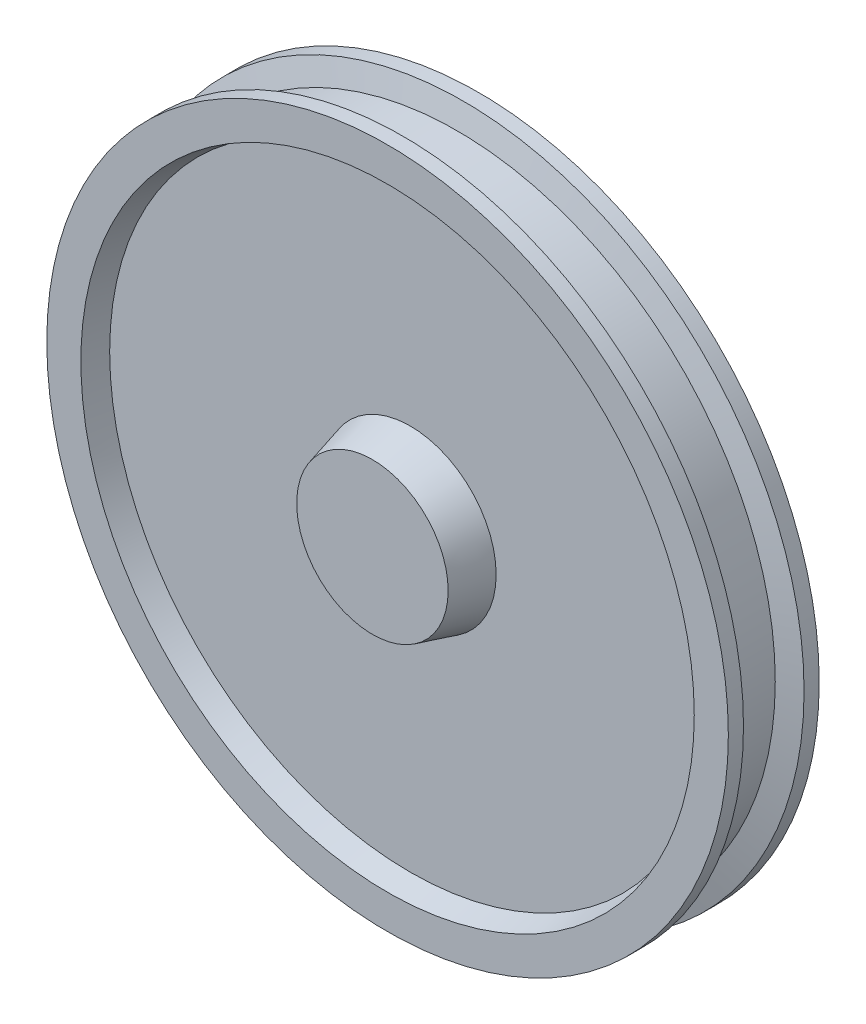
ISO-10303-21;
HEADER;
FILE_DESCRIPTION(('STEP AP214'),'2;1');
FILE_NAME('part.step','',(''),(''),'','','');
FILE_SCHEMA(('AUTOMOTIVE_DESIGN { 1 0 10303 214 1 1 1 1 }'));
ENDSEC;
DATA;
#1=APPLICATION_CONTEXT('core data for automotive mechanical design processes');
#2=APPLICATION_PROTOCOL_DEFINITION('international standard','automotive_design',2000,#1);
#3=PRODUCT_CONTEXT('',#1,'mechanical');
#4=PRODUCT('Part','Part','',(#3));
#5=PRODUCT_RELATED_PRODUCT_CATEGORY('part','',(#4));
#6=PRODUCT_DEFINITION_FORMATION('','',#4);
#7=PRODUCT_DEFINITION_CONTEXT('part definition',#1,'design');
#8=PRODUCT_DEFINITION('design','',#6,#7);
#9=PRODUCT_DEFINITION_SHAPE('','',#8);
#10=(LENGTH_UNIT() NAMED_UNIT(*) SI_UNIT(.MILLI.,.METRE.));
#11=(NAMED_UNIT(*) PLANE_ANGLE_UNIT() SI_UNIT($,.RADIAN.));
#12=(NAMED_UNIT(*) SI_UNIT($,.STERADIAN.) SOLID_ANGLE_UNIT());
#13=UNCERTAINTY_MEASURE_WITH_UNIT(LENGTH_MEASURE(1.E-05),#10,'distance_accuracy_value','');
#14=(GEOMETRIC_REPRESENTATION_CONTEXT(3) GLOBAL_UNCERTAINTY_ASSIGNED_CONTEXT((#13)) GLOBAL_UNIT_ASSIGNED_CONTEXT((#10,
#11,#12)) REPRESENTATION_CONTEXT('',''));
#15=CARTESIAN_POINT('',(0.,0.,0.));
#16=DIRECTION('',(0.,0.,1.));
#17=DIRECTION('',(1.,0.,0.));
#18=AXIS2_PLACEMENT_3D('',#15,#16,#17);
#19=CARTESIAN_POINT('',(0.,0.,60.));
#20=DIRECTION('',(0.,0.,1.));
#21=DIRECTION('',(1.,0.,0.));
#22=AXIS2_PLACEMENT_3D('',#19,#20,#21);
#23=CONICAL_SURFACE('',#22,405.,0.261799387799142);
#24=CARTESIAN_POINT('',(0.,0.,30.));
#25=DIRECTION('',(0.,0.,1.));
#26=DIRECTION('',(1.,0.,0.));
#27=AXIS2_PLACEMENT_3D('',#24,#25,#26);
#28=CIRCLE('',#27,396.961524227067);
#29=CARTESIAN_POINT('',(396.961524227067,0.,30.));
#30=VERTEX_POINT('',#29);
#31=EDGE_CURVE('E10',#30,#30,#28,.T.);
#32=ORIENTED_EDGE('',*,*,#31,.F.);
#33=EDGE_LOOP('',(#32));
#34=FACE_BOUND('',#33,.T.);
#35=CARTESIAN_POINT('',(0.,0.,60.));
#36=DIRECTION('',(0.,0.,1.));
#37=DIRECTION('',(1.,0.,0.));
#38=AXIS2_PLACEMENT_3D('',#35,#36,#37);
#39=CIRCLE('',#38,405.);
#40=CARTESIAN_POINT('',(405.,0.,60.));
#41=VERTEX_POINT('',#40);
#42=EDGE_CURVE('E96',#41,#41,#39,.T.);
#43=ORIENTED_EDGE('',*,*,#42,.T.);
#44=EDGE_LOOP('',(#43));
#45=FACE_BOUND('',#44,.T.);
#46=ADVANCED_FACE('F37',(#34,#45),#23,.F.);
#47=CARTESIAN_POINT('',(0.,113.397459621556,30.));
#48=DIRECTION('',(0.,0.,-1.));
#49=DIRECTION('',(-1.,0.,0.));
#50=AXIS2_PLACEMENT_3D('',#47,#48,#49);
#51=PLANE('',#50);
#52=CARTESIAN_POINT('',(0.,0.,30.));
#53=DIRECTION('',(0.,0.,1.));
#54=DIRECTION('',(1.,0.,0.));
#55=AXIS2_PLACEMENT_3D('',#52,#53,#54);
#56=CIRCLE('',#55,113.397459621556);
#57=CARTESIAN_POINT('',(113.397459621556,0.,30.));
#58=VERTEX_POINT('',#57);
#59=EDGE_CURVE('E44',#58,#58,#56,.T.);
#60=ORIENTED_EDGE('',*,*,#59,.F.);
#61=EDGE_LOOP('',(#60));
#62=FACE_BOUND('',#61,.T.);
#63=ORIENTED_EDGE('',*,*,#31,.T.);
#64=EDGE_LOOP('',(#63));
#65=FACE_BOUND('',#64,.T.);
#66=ADVANCED_FACE('F173',(#62,#65),#51,.F.);
#67=CARTESIAN_POINT('',(0.,0.,30.));
#68=DIRECTION('',(0.,0.,-1.));
#69=DIRECTION('',(-1.,0.,0.));
#70=AXIS2_PLACEMENT_3D('',#67,#68,#69);
#71=CONICAL_SURFACE('',#70,113.397459621556,0.26179938779915);
#72=CARTESIAN_POINT('',(0.,0.,80.));
#73=DIRECTION('',(0.,0.,1.));
#74=DIRECTION('',(1.,0.,0.));
#75=AXIS2_PLACEMENT_3D('',#72,#73,#74);
#76=CIRCLE('',#75,100.);
#77=CARTESIAN_POINT('',(100.,0.,80.));
#78=VERTEX_POINT('',#77);
#79=EDGE_CURVE('E49',#78,#78,#76,.T.);
#80=ORIENTED_EDGE('',*,*,#79,.F.);
#81=EDGE_LOOP('',(#80));
#82=FACE_BOUND('',#81,.T.);
#83=ORIENTED_EDGE('',*,*,#59,.T.);
#84=EDGE_LOOP('',(#83));
#85=FACE_BOUND('',#84,.T.);
#86=ADVANCED_FACE('F169',(#82,#85),#71,.T.);
#87=CARTESIAN_POINT('',(0.,0.,80.));
#88=DIRECTION('',(0.,0.,-1.));
#89=DIRECTION('',(-1.,0.,0.));
#90=AXIS2_PLACEMENT_3D('',#87,#88,#89);
#91=PLANE('',#90);
#92=ORIENTED_EDGE('',*,*,#79,.T.);
#93=EDGE_LOOP('',(#92));
#94=FACE_BOUND('',#93,.T.);
#95=ADVANCED_FACE('F164',(#94),#91,.F.);
#96=CARTESIAN_POINT('',(0.,0.,-80.));
#97=DIRECTION('',(0.,0.,1.));
#98=DIRECTION('',(1.,0.,0.));
#99=AXIS2_PLACEMENT_3D('',#96,#97,#98);
#100=PLANE('',#99);
#101=CARTESIAN_POINT('',(0.,0.,-80.));
#102=DIRECTION('',(0.,0.,1.));
#103=DIRECTION('',(1.,0.,0.));
#104=AXIS2_PLACEMENT_3D('',#101,#102,#103);
#105=CIRCLE('',#104,100.);
#106=CARTESIAN_POINT('',(100.,0.,-80.));
#107=VERTEX_POINT('',#106);
#108=EDGE_CURVE('E54',#107,#107,#105,.T.);
#109=ORIENTED_EDGE('',*,*,#108,.F.);
#110=EDGE_LOOP('',(#109));
#111=FACE_BOUND('',#110,.T.);
#112=ADVANCED_FACE('F159',(#111),#100,.F.);
#113=CARTESIAN_POINT('',(0.,0.,-80.));
#114=DIRECTION('',(0.,0.,1.));
#115=DIRECTION('',(1.,0.,0.));
#116=AXIS2_PLACEMENT_3D('',#113,#114,#115);
#117=CONICAL_SURFACE('',#116,100.,0.26179938779915);
#118=CARTESIAN_POINT('',(0.,0.,-30.));
#119=DIRECTION('',(0.,0.,1.));
#120=DIRECTION('',(1.,0.,0.));
#121=AXIS2_PLACEMENT_3D('',#118,#119,#120);
#122=CIRCLE('',#121,113.397459621556);
#123=CARTESIAN_POINT('',(113.397459621556,0.,-30.));
#124=VERTEX_POINT('',#123);
#125=EDGE_CURVE('E60',#124,#124,#122,.T.);
#126=ORIENTED_EDGE('',*,*,#125,.F.);
#127=EDGE_LOOP('',(#126));
#128=FACE_BOUND('',#127,.T.);
#129=ORIENTED_EDGE('',*,*,#108,.T.);
#130=EDGE_LOOP('',(#129));
#131=FACE_BOUND('',#130,.T.);
#132=ADVANCED_FACE('F153',(#128,#131),#117,.T.);
#133=CARTESIAN_POINT('',(0.,113.397459621556,-30.));
#134=DIRECTION('',(0.,0.,1.));
#135=DIRECTION('',(1.,0.,0.));
#136=AXIS2_PLACEMENT_3D('',#133,#134,#135);
#137=PLANE('',#136);
#138=CARTESIAN_POINT('',(0.,0.,-30.));
#139=DIRECTION('',(0.,0.,1.));
#140=DIRECTION('',(1.,0.,0.));
#141=AXIS2_PLACEMENT_3D('',#138,#139,#140);
#142=CIRCLE('',#141,396.961524227067);
#143=CARTESIAN_POINT('',(396.961524227067,0.,-30.));
#144=VERTEX_POINT('',#143);
#145=EDGE_CURVE('E64',#144,#144,#142,.T.);
#146=ORIENTED_EDGE('',*,*,#145,.F.);
#147=EDGE_LOOP('',(#146));
#148=FACE_BOUND('',#147,.T.);
#149=ORIENTED_EDGE('',*,*,#125,.T.);
#150=EDGE_LOOP('',(#149));
#151=FACE_BOUND('',#150,.T.);
#152=ADVANCED_FACE('F147',(#148,#151),#137,.F.);
#153=CARTESIAN_POINT('',(0.,0.,-30.));
#154=DIRECTION('',(0.,0.,-1.));
#155=DIRECTION('',(-1.,0.,0.));
#156=AXIS2_PLACEMENT_3D('',#153,#154,#155);
#157=CONICAL_SURFACE('',#156,396.961524227067,0.261799387799142);
#158=CARTESIAN_POINT('',(0.,0.,-60.));
#159=DIRECTION('',(0.,0.,1.));
#160=DIRECTION('',(1.,0.,0.));
#161=AXIS2_PLACEMENT_3D('',#158,#159,#160);
#162=CIRCLE('',#161,405.);
#163=CARTESIAN_POINT('',(405.,0.,-60.));
#164=VERTEX_POINT('',#163);
#165=EDGE_CURVE('E68',#164,#164,#162,.T.);
#166=ORIENTED_EDGE('',*,*,#165,.F.);
#167=EDGE_LOOP('',(#166));
#168=FACE_BOUND('',#167,.T.);
#169=ORIENTED_EDGE('',*,*,#145,.T.);
#170=EDGE_LOOP('',(#169));
#171=FACE_BOUND('',#170,.T.);
#172=ADVANCED_FACE('F141',(#168,#171),#157,.F.);
#173=CARTESIAN_POINT('',(0.,405.,-60.));
#174=DIRECTION('',(0.,0.,1.));
#175=DIRECTION('',(1.,0.,0.));
#176=AXIS2_PLACEMENT_3D('',#173,#174,#175);
#177=PLANE('',#176);
#178=CARTESIAN_POINT('',(0.,0.,-60.));
#179=DIRECTION('',(0.,0.,1.));
#180=DIRECTION('',(1.,0.,0.));
#181=AXIS2_PLACEMENT_3D('',#178,#179,#180);
#182=CIRCLE('',#181,450.);
#183=CARTESIAN_POINT('',(450.,0.,-60.));
#184=VERTEX_POINT('',#183);
#185=EDGE_CURVE('E72',#184,#184,#182,.T.);
#186=ORIENTED_EDGE('',*,*,#185,.F.);
#187=EDGE_LOOP('',(#186));
#188=FACE_BOUND('',#187,.T.);
#189=ORIENTED_EDGE('',*,*,#165,.T.);
#190=EDGE_LOOP('',(#189));
#191=FACE_BOUND('',#190,.T.);
#192=ADVANCED_FACE('F135',(#188,#191),#177,.F.);
#193=CARTESIAN_POINT('',(0.,0.,80.));
#194=DIRECTION('',(0.,0.,1.));
#195=DIRECTION('',(1.,0.,0.));
#196=AXIS2_PLACEMENT_3D('',#193,#194,#195);
#197=CYLINDRICAL_SURFACE('',#196,450.);
#198=CARTESIAN_POINT('',(0.,0.,-40.));
#199=DIRECTION('',(0.,0.,1.));
#200=DIRECTION('',(1.,0.,0.));
#201=AXIS2_PLACEMENT_3D('',#198,#199,#200);
#202=CIRCLE('',#201,450.);
#203=CARTESIAN_POINT('',(450.,0.,-40.));
#204=VERTEX_POINT('',#203);
#205=EDGE_CURVE('E76',#204,#204,#202,.T.);
#206=ORIENTED_EDGE('',*,*,#205,.F.);
#207=EDGE_LOOP('',(#206));
#208=FACE_BOUND('',#207,.T.);
#209=ORIENTED_EDGE('',*,*,#185,.T.);
#210=EDGE_LOOP('',(#209));
#211=FACE_BOUND('',#210,.T.);
#212=ADVANCED_FACE('F129',(#208,#211),#197,.T.);
#213=CARTESIAN_POINT('',(0.,0.,-40.));
#214=DIRECTION('',(0.,0.,-1.));
#215=DIRECTION('',(-1.,0.,0.));
#216=AXIS2_PLACEMENT_3D('',#213,#214,#215);
#217=CONICAL_SURFACE('',#216,450.,1.30899693899575);
#218=CARTESIAN_POINT('',(0.,0.,-31.9615242270665));
#219=DIRECTION('',(0.,0.,1.));
#220=DIRECTION('',(1.,0.,0.));
#221=AXIS2_PLACEMENT_3D('',#218,#219,#220);
#222=CIRCLE('',#221,420.);
#223=CARTESIAN_POINT('',(420.,0.,-31.9615242270665));
#224=VERTEX_POINT('',#223);
#225=EDGE_CURVE('E80',#224,#224,#222,.T.);
#226=ORIENTED_EDGE('',*,*,#225,.F.);
#227=EDGE_LOOP('',(#226));
#228=FACE_BOUND('',#227,.T.);
#229=ORIENTED_EDGE('',*,*,#205,.T.);
#230=EDGE_LOOP('',(#229));
#231=FACE_BOUND('',#230,.T.);
#232=ADVANCED_FACE('F123',(#228,#231),#217,.T.);
#233=CARTESIAN_POINT('',(0.,0.,80.));
#234=DIRECTION('',(0.,0.,1.));
#235=DIRECTION('',(1.,0.,0.));
#236=AXIS2_PLACEMENT_3D('',#233,#234,#235);
#237=CYLINDRICAL_SURFACE('',#236,420.);
#238=CARTESIAN_POINT('',(0.,0.,31.9615242270665));
#239=DIRECTION('',(0.,0.,1.));
#240=DIRECTION('',(1.,0.,0.));
#241=AXIS2_PLACEMENT_3D('',#238,#239,#240);
#242=CIRCLE('',#241,420.);
#243=CARTESIAN_POINT('',(420.,0.,31.9615242270665));
#244=VERTEX_POINT('',#243);
#245=EDGE_CURVE('E84',#244,#244,#242,.T.);
#246=ORIENTED_EDGE('',*,*,#245,.F.);
#247=EDGE_LOOP('',(#246));
#248=FACE_BOUND('',#247,.T.);
#249=ORIENTED_EDGE('',*,*,#225,.T.);
#250=EDGE_LOOP('',(#249));
#251=FACE_BOUND('',#250,.T.);
#252=ADVANCED_FACE('F117',(#248,#251),#237,.T.);
#253=CARTESIAN_POINT('',(0.,0.,31.9615242270665));
#254=DIRECTION('',(0.,0.,1.));
#255=DIRECTION('',(1.,0.,0.));
#256=AXIS2_PLACEMENT_3D('',#253,#254,#255);
#257=CONICAL_SURFACE('',#256,420.,1.30899693899575);
#258=CARTESIAN_POINT('',(0.,0.,40.));
#259=DIRECTION('',(0.,0.,1.));
#260=DIRECTION('',(1.,0.,0.));
#261=AXIS2_PLACEMENT_3D('',#258,#259,#260);
#262=CIRCLE('',#261,450.);
#263=CARTESIAN_POINT('',(450.,0.,40.));
#264=VERTEX_POINT('',#263);
#265=EDGE_CURVE('E88',#264,#264,#262,.T.);
#266=ORIENTED_EDGE('',*,*,#265,.F.);
#267=EDGE_LOOP('',(#266));
#268=FACE_BOUND('',#267,.T.);
#269=ORIENTED_EDGE('',*,*,#245,.T.);
#270=EDGE_LOOP('',(#269));
#271=FACE_BOUND('',#270,.T.);
#272=ADVANCED_FACE('F111',(#268,#271),#257,.T.);
#273=CARTESIAN_POINT('',(0.,0.,80.));
#274=DIRECTION('',(0.,0.,1.));
#275=DIRECTION('',(1.,0.,0.));
#276=AXIS2_PLACEMENT_3D('',#273,#274,#275);
#277=CYLINDRICAL_SURFACE('',#276,450.);
#278=CARTESIAN_POINT('',(0.,0.,60.));
#279=DIRECTION('',(0.,0.,1.));
#280=DIRECTION('',(1.,0.,0.));
#281=AXIS2_PLACEMENT_3D('',#278,#279,#280);
#282=CIRCLE('',#281,450.);
#283=CARTESIAN_POINT('',(450.,0.,60.));
#284=VERTEX_POINT('',#283);
#285=EDGE_CURVE('E92',#284,#284,#282,.T.);
#286=ORIENTED_EDGE('',*,*,#285,.F.);
#287=EDGE_LOOP('',(#286));
#288=FACE_BOUND('',#287,.T.);
#289=ORIENTED_EDGE('',*,*,#265,.T.);
#290=EDGE_LOOP('',(#289));
#291=FACE_BOUND('',#290,.T.);
#292=ADVANCED_FACE('F105',(#288,#291),#277,.T.);
#293=CARTESIAN_POINT('',(0.,405.,60.));
#294=DIRECTION('',(0.,0.,-1.));
#295=DIRECTION('',(-1.,0.,0.));
#296=AXIS2_PLACEMENT_3D('',#293,#294,#295);
#297=PLANE('',#296);
#298=ORIENTED_EDGE('',*,*,#42,.F.);
#299=EDGE_LOOP('',(#298));
#300=FACE_BOUND('',#299,.T.);
#301=ORIENTED_EDGE('',*,*,#285,.T.);
#302=EDGE_LOOP('',(#301));
#303=FACE_BOUND('',#302,.T.);
#304=ADVANCED_FACE('F102',(#300,#303),#297,.F.);
#305=CLOSED_SHELL('',(#46,#66,#86,#95,#112,#132,#152,#172,#192,#212,#232,#252,#272,#292,#304));
#306=MANIFOLD_SOLID_BREP('B2',#305);
#307=ADVANCED_BREP_SHAPE_REPRESENTATION('',(#18,#306),#14);
#308=SHAPE_DEFINITION_REPRESENTATION(#9,#307);
ENDSEC;
END-ISO-10303-21;
